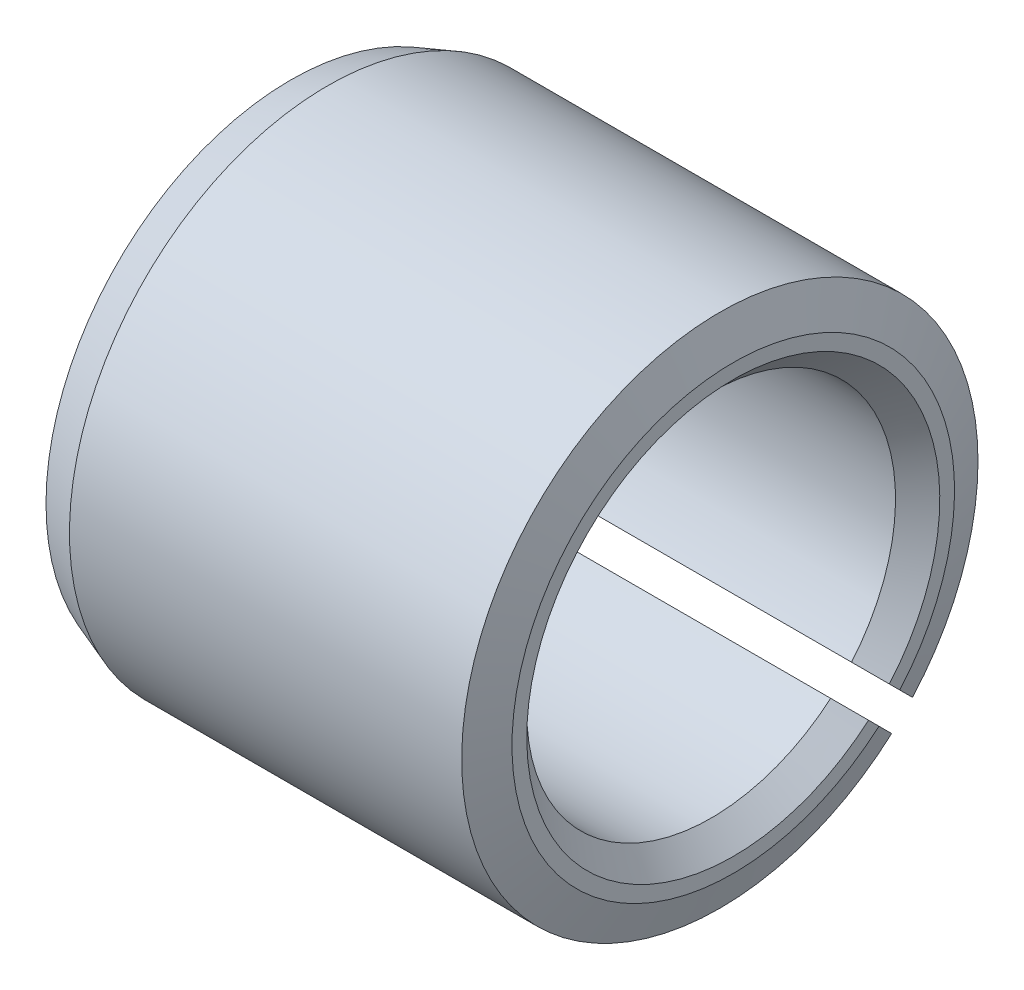
ISO-10303-21;
HEADER;
FILE_DESCRIPTION(('STEP AP214'),'2;1');
FILE_NAME('part.step','',(''),(''),'','','');
FILE_SCHEMA(('AUTOMOTIVE_DESIGN { 1 0 10303 214 1 1 1 1 }'));
ENDSEC;
DATA;
#1=APPLICATION_CONTEXT('core data for automotive mechanical design processes');
#2=APPLICATION_PROTOCOL_DEFINITION('international standard','automotive_design',2000,#1);
#3=PRODUCT_CONTEXT('',#1,'mechanical');
#4=PRODUCT('Part','Part','',(#3));
#5=PRODUCT_RELATED_PRODUCT_CATEGORY('part','',(#4));
#6=PRODUCT_DEFINITION_FORMATION('','',#4);
#7=PRODUCT_DEFINITION_CONTEXT('part definition',#1,'design');
#8=PRODUCT_DEFINITION('design','',#6,#7);
#9=PRODUCT_DEFINITION_SHAPE('','',#8);
#10=(LENGTH_UNIT() NAMED_UNIT(*) SI_UNIT(.MILLI.,.METRE.));
#11=(NAMED_UNIT(*) PLANE_ANGLE_UNIT() SI_UNIT($,.RADIAN.));
#12=(NAMED_UNIT(*) SI_UNIT($,.STERADIAN.) SOLID_ANGLE_UNIT());
#13=UNCERTAINTY_MEASURE_WITH_UNIT(LENGTH_MEASURE(1.E-05),#10,'distance_accuracy_value','');
#14=(GEOMETRIC_REPRESENTATION_CONTEXT(3) GLOBAL_UNCERTAINTY_ASSIGNED_CONTEXT((#13)) GLOBAL_UNIT_ASSIGNED_CONTEXT((#10,
#11,#12)) REPRESENTATION_CONTEXT('',''));
#15=CARTESIAN_POINT('',(0.,0.,0.));
#16=DIRECTION('',(0.,0.,1.));
#17=DIRECTION('',(1.,0.,0.));
#18=AXIS2_PLACEMENT_3D('',#15,#16,#17);
#19=CARTESIAN_POINT('',(0.,0.,0.));
#20=DIRECTION('',(1.,0.,0.));
#21=DIRECTION('',(0.,0.,-1.));
#22=AXIS2_PLACEMENT_3D('',#19,#20,#21);
#23=CYLINDRICAL_SURFACE('',#22,3.5);
#24=DIRECTION('',(-1.,0.,0.));
#25=VECTOR('',#24,1.);
#26=CARTESIAN_POINT('',(6.,-2.61225117635847,-2.32940846388386));
#27=LINE('',#26,#25);
#28=CARTESIAN_POINT('',(5.8180148828669,-2.61225117635847,-2.32940846388386));
#29=VERTEX_POINT('',#28);
#30=CARTESIAN_POINT('',(0.500000000000007,-2.61225117635847,-2.32940846388386));
#31=VERTEX_POINT('',#30);
#32=EDGE_CURVE('E126',#29,#31,#27,.T.);
#33=ORIENTED_EDGE('',*,*,#32,.F.);
#34=CARTESIAN_POINT('',(5.8180148828669,0.,0.));
#35=DIRECTION('',(1.,0.,0.));
#36=DIRECTION('',(0.,0.,-1.));
#37=AXIS2_PLACEMENT_3D('',#34,#35,#36);
#38=CIRCLE('',#37,3.5);
#39=CARTESIAN_POINT('',(5.8180148828669,-2.32940846388386,-2.61225117635847));
#40=VERTEX_POINT('',#39);
#41=EDGE_CURVE('E194',#29,#40,#38,.F.);
#42=ORIENTED_EDGE('',*,*,#41,.T.);
#43=DIRECTION('',(-1.,0.,0.));
#44=VECTOR('',#43,1.);
#45=CARTESIAN_POINT('',(6.,-2.32940846388386,-2.61225117635847));
#46=LINE('',#45,#44);
#47=CARTESIAN_POINT('',(0.500000000000007,-2.32940846388386,-2.61225117635847));
#48=VERTEX_POINT('',#47);
#49=EDGE_CURVE('E128',#40,#48,#46,.T.);
#50=ORIENTED_EDGE('',*,*,#49,.T.);
#51=CARTESIAN_POINT('',(0.500000000000007,0.,0.));
#52=DIRECTION('',(-1.,0.,0.));
#53=DIRECTION('',(0.,0.,1.));
#54=AXIS2_PLACEMENT_3D('',#51,#52,#53);
#55=CIRCLE('',#54,3.5);
#56=EDGE_CURVE('E178',#48,#31,#55,.F.);
#57=ORIENTED_EDGE('',*,*,#56,.T.);
#58=EDGE_LOOP('',(#33,#42,#50,#57));
#59=FACE_BOUND('',#58,.T.);
#60=ADVANCED_FACE('F35',(#59),#23,.T.);
#61=CARTESIAN_POINT('',(0.,3.5,0.));
#62=DIRECTION('',(-1.,0.,0.));
#63=DIRECTION('',(0.,0.,1.));
#64=AXIS2_PLACEMENT_3D('',#61,#62,#63);
#65=PLANE('',#64);
#66=DIRECTION('',(0.,0.707106781186546,0.707106781186549));
#67=VECTOR('',#66,1.);
#68=CARTESIAN_POINT('',(0.,-2.61225117635847,-2.32940846388386));
#69=LINE('',#68,#67);
#70=CARTESIAN_POINT('',(0.,-2.48334607352928,-2.20050336105467));
#71=VERTEX_POINT('',#70);
#72=CARTESIAN_POINT('',(0.,-2.11626312205046,-1.83342040957585));
#73=VERTEX_POINT('',#72);
#74=EDGE_CURVE('E233',#71,#73,#69,.T.);
#75=ORIENTED_EDGE('',*,*,#74,.F.);
#76=CARTESIAN_POINT('',(0.,0.,0.));
#77=DIRECTION('',(-1.,0.,0.));
#78=DIRECTION('',(0.,0.,1.));
#79=AXIS2_PLACEMENT_3D('',#76,#77,#78);
#80=CIRCLE('',#79,3.3180148828669);
#81=CARTESIAN_POINT('',(0.,-2.20050336105467,-2.48334607352928));
#82=VERTEX_POINT('',#81);
#83=EDGE_CURVE('E11',#71,#82,#80,.T.);
#84=ORIENTED_EDGE('',*,*,#83,.T.);
#85=DIRECTION('',(0.,-0.707106781186549,-0.707106781186546));
#86=VECTOR('',#85,1.);
#87=CARTESIAN_POINT('',(0.,-1.6206796624333,-1.90352237490792));
#88=LINE('',#87,#86);
#89=CARTESIAN_POINT('',(0.,-1.83342040957584,-2.11626312205046));
#90=VERTEX_POINT('',#89);
#91=EDGE_CURVE('E234',#90,#82,#88,.T.);
#92=ORIENTED_EDGE('',*,*,#91,.F.);
#93=CARTESIAN_POINT('',(0.,0.,0.));
#94=DIRECTION('',(-1.,0.,0.));
#95=DIRECTION('',(0.,0.,1.));
#96=AXIS2_PLACEMENT_3D('',#93,#94,#95);
#97=CIRCLE('',#96,2.8);
#98=EDGE_CURVE('E208',#90,#73,#97,.F.);
#99=ORIENTED_EDGE('',*,*,#98,.T.);
#100=EDGE_LOOP('',(#75,#84,#92,#99));
#101=FACE_BOUND('',#100,.T.);
#102=ADVANCED_FACE('F228',(#101),#65,.T.);
#103=CARTESIAN_POINT('',(6.,0.,0.));
#104=DIRECTION('',(1.,0.,0.));
#105=DIRECTION('',(0.,0.,-1.));
#106=AXIS2_PLACEMENT_3D('',#103,#104,#105);
#107=PLANE('',#106);
#108=DIRECTION('',(0.,-0.707106781186549,-0.707106781186546));
#109=VECTOR('',#108,1.);
#110=CARTESIAN_POINT('',(6.,-1.6206796624333,-1.90352237490792));
#111=LINE('',#110,#109);
#112=CARTESIAN_POINT('',(6.,-1.83342040957584,-2.11626312205046));
#113=VERTEX_POINT('',#112);
#114=CARTESIAN_POINT('',(6.,-1.97517969261437,-2.25802240508898));
#115=VERTEX_POINT('',#114);
#116=EDGE_CURVE('E131',#113,#115,#111,.T.);
#117=ORIENTED_EDGE('',*,*,#116,.T.);
#118=CARTESIAN_POINT('',(6.,0.,0.));
#119=DIRECTION('',(1.,0.,0.));
#120=DIRECTION('',(0.,0.,-1.));
#121=AXIS2_PLACEMENT_3D('',#118,#119,#120);
#122=CIRCLE('',#121,3.00000000000001);
#123=CARTESIAN_POINT('',(6.,-2.25802240508898,-1.97517969261437));
#124=VERTEX_POINT('',#123);
#125=EDGE_CURVE('E171',#115,#124,#122,.T.);
#126=ORIENTED_EDGE('',*,*,#125,.T.);
#127=DIRECTION('',(0.,0.707106781186546,0.707106781186549));
#128=VECTOR('',#127,1.);
#129=CARTESIAN_POINT('',(6.,-2.61225117635847,-2.32940846388386));
#130=LINE('',#129,#128);
#131=CARTESIAN_POINT('',(6.,-2.11626312205046,-1.83342040957584));
#132=VERTEX_POINT('',#131);
#133=EDGE_CURVE('E201',#124,#132,#130,.T.);
#134=ORIENTED_EDGE('',*,*,#133,.T.);
#135=CARTESIAN_POINT('',(6.,0.,0.));
#136=DIRECTION('',(1.,0.,0.));
#137=DIRECTION('',(0.,0.,-1.));
#138=AXIS2_PLACEMENT_3D('',#135,#136,#137);
#139=CIRCLE('',#138,2.8);
#140=EDGE_CURVE('E108',#132,#113,#139,.F.);
#141=ORIENTED_EDGE('',*,*,#140,.T.);
#142=EDGE_LOOP('',(#117,#126,#134,#141));
#143=FACE_BOUND('',#142,.T.);
#144=ADVANCED_FACE('F157',(#143),#107,.T.);
#145=CARTESIAN_POINT('',(6.,-1.6206796624333,-1.90352237490792));
#146=DIRECTION('',(0.,0.707106781186546,-0.707106781186549));
#147=DIRECTION('',(0.,0.707106781186549,0.707106781186546));
#148=AXIS2_PLACEMENT_3D('',#145,#146,#147);
#149=PLANE('',#148);
#150=ORIENTED_EDGE('',*,*,#49,.F.);
#151=CARTESIAN_POINT('',(5.8180148828669,-2.32940846388386,-2.61225117635847));
#152=CARTESIAN_POINT('',(5.84835361790177,-2.27037236008618,-2.55321507256079));
#153=CARTESIAN_POINT('',(5.87868841184437,-2.21133524391994,-2.49417795639455));
#154=CARTESIAN_POINT('',(5.9393501175554,-2.09325898683011,-2.37610169930472));
#155=CARTESIAN_POINT('',(5.96967702932384,-2.03421984590652,-2.31706255838113));
#156=CARTESIAN_POINT('',(6.,-1.97517969261437,-2.25802240508898));
#157=B_SPLINE_CURVE_WITH_KNOTS('',3,(#151,#152,#153,#154,#155,#156),.UNSPECIFIED.,.F.,.F.,(4,2,
4),(0.,0.26649325891273,0.53298651791681),.UNSPECIFIED.);
#158=EDGE_CURVE('E44',#40,#115,#157,.T.);
#159=ORIENTED_EDGE('',*,*,#158,.T.);
#160=ORIENTED_EDGE('',*,*,#116,.F.);
#161=CARTESIAN_POINT('',(6.,-1.83342040957584,-2.11626312205046));
#162=CARTESIAN_POINT('',(5.94999184383762,-1.79796936918778,-2.08081208166239));
#163=CARTESIAN_POINT('',(5.89998776576578,-1.76251545340517,-2.04535816587978));
#164=CARTESIAN_POINT('',(5.79998776576578,-1.69160187102433,-1.97444458349894));
#165=CARTESIAN_POINT('',(5.74999184383761,-1.65614220442609,-1.9389849169007));
#166=CARTESIAN_POINT('',(5.7,-1.6206796624333,-1.90352237490792));
#167=B_SPLINE_CURVE_WITH_KNOTS('',3,(#161,#162,#163,#164,#165,#166),.UNSPECIFIED.,.F.,.F.,(4,2,
4),(0.,0.212436609396991,0.424873218953054),.UNSPECIFIED.);
#168=CARTESIAN_POINT('',(5.7,-1.6206796624333,-1.90352237490792));
#169=VERTEX_POINT('',#168);
#170=EDGE_CURVE('E210',#113,#169,#167,.T.);
#171=ORIENTED_EDGE('',*,*,#170,.T.);
#172=DIRECTION('',(-1.,0.,0.));
#173=VECTOR('',#172,1.);
#174=CARTESIAN_POINT('',(6.,-1.6206796624333,-1.90352237490792));
#175=LINE('',#174,#173);
#176=CARTESIAN_POINT('',(0.300000000000003,-1.6206796624333,-1.90352237490792));
#177=VERTEX_POINT('',#176);
#178=EDGE_CURVE('E121',#169,#177,#175,.T.);
#179=ORIENTED_EDGE('',*,*,#178,.T.);
#180=CARTESIAN_POINT('',(0.300000000000003,-1.6206796624333,-1.90352237490792));
#181=CARTESIAN_POINT('',(0.250008156162391,-1.65614220442609,-1.9389849169007));
#182=CARTESIAN_POINT('',(0.200012234234224,-1.69160187102433,-1.97444458349894));
#183=CARTESIAN_POINT('',(0.100012234234217,-1.76251545340517,-2.04535816587978));
#184=CARTESIAN_POINT('',(0.0500081561623834,-1.79796936918778,-2.08081208166239));
#185=CARTESIAN_POINT('',(0.,-1.83342040957584,-2.11626312205046));
#186=B_SPLINE_CURVE_WITH_KNOTS('',3,(#180,#181,#182,#183,#184,#185),.UNSPECIFIED.,.F.,.F.,(4,2,
4),(0.,0.212436609556065,0.424873218953057),.UNSPECIFIED.);
#187=EDGE_CURVE('E212',#177,#90,#186,.T.);
#188=ORIENTED_EDGE('',*,*,#187,.T.);
#189=ORIENTED_EDGE('',*,*,#91,.T.);
#190=CARTESIAN_POINT('',(0.,-2.20050336105467,-2.48334607352928));
#191=CARTESIAN_POINT('',(0.0833324312728003,-2.22198929432692,-2.50483200680153));
#192=CARTESIAN_POINT('',(0.166665313576113,-2.24347435286553,-2.52631706534014));
#193=CARTESIAN_POINT('',(0.333331980242782,-2.28644272047526,-2.56928543294987));
#194=CARTESIAN_POINT('',(0.416665764606138,-2.30792602954638,-2.59076874202099));
#195=CARTESIAN_POINT('',(0.500000000000007,-2.32940846388386,-2.61225117635847));
#196=B_SPLINE_CURVE_WITH_KNOTS('',3,(#190,#191,#192,#193,#194,#195),.UNSPECIFIED.,.F.,.F.,(4,2,
4),(0.,0.266098220182211,0.532196440361292),.UNSPECIFIED.);
#197=EDGE_CURVE('E56',#82,#48,#196,.T.);
#198=ORIENTED_EDGE('',*,*,#197,.T.);
#199=EDGE_LOOP('',(#150,#159,#160,#171,#179,#188,#189,#198));
#200=FACE_BOUND('',#199,.T.);
#201=ADVANCED_FACE('F154',(#200),#149,.F.);
#202=CARTESIAN_POINT('',(6.,-2.61225117635847,-2.32940846388386));
#203=DIRECTION('',(0.,-0.707106781186549,0.707106781186546));
#204=DIRECTION('',(0.,-0.707106781186546,-0.707106781186549));
#205=AXIS2_PLACEMENT_3D('',#202,#203,#204);
#206=PLANE('',#205);
#207=ORIENTED_EDGE('',*,*,#133,.F.);
#208=CARTESIAN_POINT('',(6.,-2.25802240508898,-1.97517969261437));
#209=CARTESIAN_POINT('',(5.96967702932384,-2.31706255838113,-2.03421984590652));
#210=CARTESIAN_POINT('',(5.9393501175554,-2.37610169930472,-2.09325898683011));
#211=CARTESIAN_POINT('',(5.87868841184437,-2.49417795639455,-2.21133524391994));
#212=CARTESIAN_POINT('',(5.84835361790177,-2.55321507256079,-2.27037236008618));
#213=CARTESIAN_POINT('',(5.8180148828669,-2.61225117635847,-2.32940846388386));
#214=B_SPLINE_CURVE_WITH_KNOTS('',3,(#208,#209,#210,#211,#212,#213),.UNSPECIFIED.,.F.,.F.,(4,2,
4),(0.,0.266493259004081,0.532986517916811),.UNSPECIFIED.);
#215=EDGE_CURVE('E170',#124,#29,#214,.T.);
#216=ORIENTED_EDGE('',*,*,#215,.T.);
#217=ORIENTED_EDGE('',*,*,#32,.T.);
#218=CARTESIAN_POINT('',(0.500000000000007,-2.61225117635847,-2.32940846388386));
#219=CARTESIAN_POINT('',(0.416665764606139,-2.59076874202099,-2.30792602954638));
#220=CARTESIAN_POINT('',(0.333331980242782,-2.56928543294987,-2.28644272047526));
#221=CARTESIAN_POINT('',(0.166665313576113,-2.52631706534014,-2.24347435286553));
#222=CARTESIAN_POINT('',(0.0833324312728004,-2.50483200680153,-2.22198929432692));
#223=CARTESIAN_POINT('',(0.,-2.48334607352928,-2.20050336105467));
#224=B_SPLINE_CURVE_WITH_KNOTS('',3,(#218,#219,#220,#221,#222,#223),.UNSPECIFIED.,.F.,.F.,(4,2,
4),(0.,0.266098220179081,0.532196440361292),.UNSPECIFIED.);
#225=EDGE_CURVE('E164',#31,#71,#224,.T.);
#226=ORIENTED_EDGE('',*,*,#225,.T.);
#227=ORIENTED_EDGE('',*,*,#74,.T.);
#228=CARTESIAN_POINT('',(0.,-2.11626312205046,-1.83342040957585));
#229=CARTESIAN_POINT('',(0.0500081561623833,-2.08081208166239,-1.79796936918778));
#230=CARTESIAN_POINT('',(0.100012234234217,-2.04535816587978,-1.76251545340517));
#231=CARTESIAN_POINT('',(0.200012234234224,-1.97444458349894,-1.69160187102433));
#232=CARTESIAN_POINT('',(0.250008156162391,-1.9389849169007,-1.65614220442609));
#233=CARTESIAN_POINT('',(0.300000000000002,-1.90352237490792,-1.6206796624333));
#234=B_SPLINE_CURVE_WITH_KNOTS('',3,(#228,#229,#230,#231,#232,#233),.UNSPECIFIED.,.F.,.F.,(4,2,
4),(0.,0.212436609396993,0.424873218953057),.UNSPECIFIED.);
#235=CARTESIAN_POINT('',(0.300000000000003,-1.90352237490792,-1.6206796624333));
#236=VERTEX_POINT('',#235);
#237=EDGE_CURVE('E112',#73,#236,#234,.T.);
#238=ORIENTED_EDGE('',*,*,#237,.T.);
#239=DIRECTION('',(-1.,0.,0.));
#240=VECTOR('',#239,1.);
#241=CARTESIAN_POINT('',(6.,-1.90352237490792,-1.6206796624333));
#242=LINE('',#241,#240);
#243=CARTESIAN_POINT('',(5.7,-1.90352237490792,-1.6206796624333));
#244=VERTEX_POINT('',#243);
#245=EDGE_CURVE('E118',#244,#236,#242,.T.);
#246=ORIENTED_EDGE('',*,*,#245,.F.);
#247=CARTESIAN_POINT('',(5.7,-1.90352237490792,-1.6206796624333));
#248=CARTESIAN_POINT('',(5.74999184383761,-1.9389849169007,-1.65614220442609));
#249=CARTESIAN_POINT('',(5.79998776576578,-1.97444458349894,-1.69160187102433));
#250=CARTESIAN_POINT('',(5.89998776576578,-2.04535816587978,-1.76251545340517));
#251=CARTESIAN_POINT('',(5.94999184383762,-2.08081208166239,-1.79796936918778));
#252=CARTESIAN_POINT('',(6.,-2.11626312205046,-1.83342040957584));
#253=B_SPLINE_CURVE_WITH_KNOTS('',3,(#247,#248,#249,#250,#251,#252),.UNSPECIFIED.,.F.,.F.,(4,2,
4),(0.,0.212436609556063,0.424873218953054),.UNSPECIFIED.);
#254=EDGE_CURVE('E103',#244,#132,#253,.T.);
#255=ORIENTED_EDGE('',*,*,#254,.T.);
#256=EDGE_LOOP('',(#207,#216,#217,#226,#227,#238,#246,#255));
#257=FACE_BOUND('',#256,.T.);
#258=ADVANCED_FACE('F124',(#257),#206,.F.);
#259=CARTESIAN_POINT('',(0.,0.,0.));
#260=DIRECTION('',(1.,0.,0.));
#261=DIRECTION('',(0.,0.,-1.));
#262=AXIS2_PLACEMENT_3D('',#259,#260,#261);
#263=CYLINDRICAL_SURFACE('',#262,2.5);
#264=ORIENTED_EDGE('',*,*,#178,.F.);
#265=CARTESIAN_POINT('',(5.7,0.,0.));
#266=DIRECTION('',(1.,0.,0.));
#267=DIRECTION('',(0.,0.,-1.));
#268=AXIS2_PLACEMENT_3D('',#265,#266,#267);
#269=CIRCLE('',#268,2.5);
#270=EDGE_CURVE('E107',#169,#244,#269,.T.);
#271=ORIENTED_EDGE('',*,*,#270,.T.);
#272=ORIENTED_EDGE('',*,*,#245,.T.);
#273=CARTESIAN_POINT('',(0.300000000000003,0.,0.));
#274=DIRECTION('',(-1.,0.,0.));
#275=DIRECTION('',(0.,0.,1.));
#276=AXIS2_PLACEMENT_3D('',#273,#274,#275);
#277=CIRCLE('',#276,2.5);
#278=EDGE_CURVE('E122',#236,#177,#277,.T.);
#279=ORIENTED_EDGE('',*,*,#278,.T.);
#280=EDGE_LOOP('',(#264,#271,#272,#279));
#281=FACE_BOUND('',#280,.T.);
#282=ADVANCED_FACE('F117',(#281),#263,.F.);
#283=CARTESIAN_POINT('',(5.7,0.,0.));
#284=DIRECTION('',(1.,0.,0.));
#285=DIRECTION('',(0.,0.,-1.));
#286=AXIS2_PLACEMENT_3D('',#283,#284,#285);
#287=CONICAL_SURFACE('',#286,2.5,0.785398163397452);
#288=ORIENTED_EDGE('',*,*,#170,.F.);
#289=ORIENTED_EDGE('',*,*,#140,.F.);
#290=ORIENTED_EDGE('',*,*,#254,.F.);
#291=ORIENTED_EDGE('',*,*,#270,.F.);
#292=EDGE_LOOP('',(#288,#289,#290,#291));
#293=FACE_BOUND('',#292,.T.);
#294=ADVANCED_FACE('F106',(#293),#287,.F.);
#295=CARTESIAN_POINT('',(0.,0.,0.));
#296=DIRECTION('',(-1.,0.,0.));
#297=DIRECTION('',(0.,0.,1.));
#298=AXIS2_PLACEMENT_3D('',#295,#296,#297);
#299=CONICAL_SURFACE('',#298,2.8,0.785398163397446);
#300=ORIENTED_EDGE('',*,*,#187,.F.);
#301=ORIENTED_EDGE('',*,*,#278,.F.);
#302=ORIENTED_EDGE('',*,*,#237,.F.);
#303=ORIENTED_EDGE('',*,*,#98,.F.);
#304=EDGE_LOOP('',(#300,#301,#302,#303));
#305=FACE_BOUND('',#304,.T.);
#306=ADVANCED_FACE('F148',(#305),#299,.F.);
#307=CARTESIAN_POINT('',(6.,0.,0.));
#308=DIRECTION('',(-1.,0.,0.));
#309=DIRECTION('',(0.,0.,1.));
#310=AXIS2_PLACEMENT_3D('',#307,#308,#309);
#311=CONICAL_SURFACE('',#310,3.00000000000001,1.22173047639603);
#312=ORIENTED_EDGE('',*,*,#158,.F.);
#313=ORIENTED_EDGE('',*,*,#41,.F.);
#314=ORIENTED_EDGE('',*,*,#215,.F.);
#315=ORIENTED_EDGE('',*,*,#125,.F.);
#316=EDGE_LOOP('',(#312,#313,#314,#315));
#317=FACE_BOUND('',#316,.T.);
#318=ADVANCED_FACE('F180',(#317),#311,.T.);
#319=CARTESIAN_POINT('',(0.500000000000007,0.,0.));
#320=DIRECTION('',(1.,0.,0.));
#321=DIRECTION('',(0.,0.,-1.));
#322=AXIS2_PLACEMENT_3D('',#319,#320,#321);
#323=CONICAL_SURFACE('',#322,3.5,0.349065850398865);
#324=ORIENTED_EDGE('',*,*,#197,.F.);
#325=ORIENTED_EDGE('',*,*,#83,.F.);
#326=ORIENTED_EDGE('',*,*,#225,.F.);
#327=ORIENTED_EDGE('',*,*,#56,.F.);
#328=EDGE_LOOP('',(#324,#325,#326,#327));
#329=FACE_BOUND('',#328,.T.);
#330=ADVANCED_FACE('F37',(#329),#323,.T.);
#331=CLOSED_SHELL('',(#60,#102,#144,#201,#258,#282,#294,#306,#318,#330));
#332=MANIFOLD_SOLID_BREP('B2',#331);
#333=ADVANCED_BREP_SHAPE_REPRESENTATION('',(#18,#332),#14);
#334=SHAPE_DEFINITION_REPRESENTATION(#9,#333);
ENDSEC;
END-ISO-10303-21;
